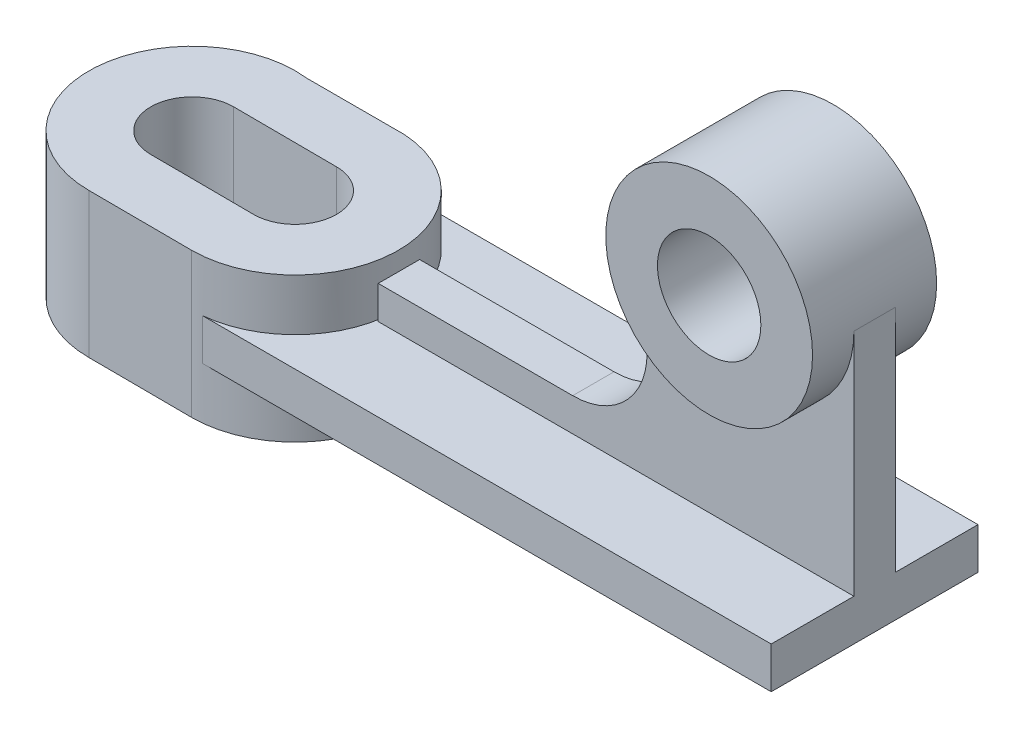
ISO-10303-21;
HEADER;
FILE_DESCRIPTION(('STEP AP214'),'2;1');
FILE_NAME('part.step','',(''),(''),'','','');
FILE_SCHEMA(('AUTOMOTIVE_DESIGN { 1 0 10303 214 1 1 1 1 }'));
ENDSEC;
DATA;
#1=APPLICATION_CONTEXT('core data for automotive mechanical design processes');
#2=APPLICATION_PROTOCOL_DEFINITION('international standard','automotive_design',2000,#1);
#3=PRODUCT_CONTEXT('',#1,'mechanical');
#4=PRODUCT('Part','Part','',(#3));
#5=PRODUCT_RELATED_PRODUCT_CATEGORY('part','',(#4));
#6=PRODUCT_DEFINITION_FORMATION('','',#4);
#7=PRODUCT_DEFINITION_CONTEXT('part definition',#1,'design');
#8=PRODUCT_DEFINITION('design','',#6,#7);
#9=PRODUCT_DEFINITION_SHAPE('','',#8);
#10=(LENGTH_UNIT() NAMED_UNIT(*) SI_UNIT(.MILLI.,.METRE.));
#11=(NAMED_UNIT(*) PLANE_ANGLE_UNIT() SI_UNIT($,.RADIAN.));
#12=(NAMED_UNIT(*) SI_UNIT($,.STERADIAN.) SOLID_ANGLE_UNIT());
#13=UNCERTAINTY_MEASURE_WITH_UNIT(LENGTH_MEASURE(1.E-05),#10,'distance_accuracy_value','');
#14=(GEOMETRIC_REPRESENTATION_CONTEXT(3) GLOBAL_UNCERTAINTY_ASSIGNED_CONTEXT((#13)) GLOBAL_UNIT_ASSIGNED_CONTEXT((#10,
#11,#12)) REPRESENTATION_CONTEXT('',''));
#15=CARTESIAN_POINT('',(0.,0.,0.));
#16=DIRECTION('',(0.,0.,1.));
#17=DIRECTION('',(1.,0.,0.));
#18=AXIS2_PLACEMENT_3D('',#15,#16,#17);
#19=CARTESIAN_POINT('',(0.,10.,0.));
#20=DIRECTION('',(0.,1.,0.));
#21=DIRECTION('',(0.,0.,1.));
#22=AXIS2_PLACEMENT_3D('',#19,#20,#21);
#23=PLANE('',#22);
#24=DIRECTION('',(0.,0.,-1.));
#25=VECTOR('',#24,1.);
#26=CARTESIAN_POINT('',(87.1408823579827,10.,-28.4439768481135));
#27=LINE('',#26,#25);
#28=CARTESIAN_POINT('',(87.1408823579827,10.,21.5560231518865));
#29=VERTEX_POINT('',#28);
#30=CARTESIAN_POINT('',(87.1408823579827,10.,1.55602315188651));
#31=VERTEX_POINT('',#30);
#32=EDGE_CURVE('E298',#29,#31,#27,.T.);
#33=ORIENTED_EDGE('',*,*,#32,.T.);
#34=DIRECTION('',(1.,0.,0.));
#35=VECTOR('',#34,1.);
#36=CARTESIAN_POINT('',(87.1408823579827,10.,1.55602315188651));
#37=LINE('',#36,#35);
#38=CARTESIAN_POINT('',(-27.8697354682345,10.,1.55602315188651));
#39=VERTEX_POINT('',#38);
#40=EDGE_CURVE('E258',#39,#31,#37,.T.);
#41=ORIENTED_EDGE('',*,*,#40,.F.);
#42=DIRECTION('',(0.,0.,1.));
#43=VECTOR('',#42,1.);
#44=CARTESIAN_POINT('',(-27.8697354682345,10.,-8.44397684811349));
#45=LINE('',#44,#43);
#46=CARTESIAN_POINT('',(-27.8697354682345,10.,-2.5831586748666));
#47=VERTEX_POINT('',#46);
#48=EDGE_CURVE('E260',#47,#39,#45,.T.);
#49=ORIENTED_EDGE('',*,*,#48,.F.);
#50=CARTESIAN_POINT('',(-52.8588817285153,10.,-3.3197516305044));
#51=DIRECTION('',(0.,1.,0.));
#52=DIRECTION('',(0.,0.,1.));
#53=AXIS2_PLACEMENT_3D('',#50,#51,#52);
#54=CIRCLE('',#53,25.);
#55=CARTESIAN_POINT('',(-50.3697395116533,10.,21.5560231518865));
#56=VERTEX_POINT('',#55);
#57=EDGE_CURVE('E348',#47,#56,#54,.F.);
#58=ORIENTED_EDGE('',*,*,#57,.T.);
#59=DIRECTION('',(1.,0.,0.));
#60=VECTOR('',#59,1.);
#61=CARTESIAN_POINT('',(-52.8591176420173,10.,21.5560231518865));
#62=LINE('',#61,#60);
#63=EDGE_CURVE('E299',#56,#29,#62,.T.);
#64=ORIENTED_EDGE('',*,*,#63,.T.);
#65=EDGE_LOOP('',(#33,#41,#49,#58,#64));
#66=FACE_BOUND('',#65,.T.);
#67=ADVANCED_FACE('F42',(#66),#23,.T.);
#68=CARTESIAN_POINT('',(-52.8591176420173,10.,-28.4439768481135));
#69=DIRECTION('',(1.,0.,0.));
#70=DIRECTION('',(0.,0.,-1.));
#71=AXIS2_PLACEMENT_3D('',#68,#69,#70);
#72=PLANE('',#71);
#73=DIRECTION('',(0.,-1.,0.));
#74=VECTOR('',#73,1.);
#75=CARTESIAN_POINT('',(-52.8591176420173,10.,-28.27501791205));
#76=LINE('',#75,#74);
#77=CARTESIAN_POINT('',(-52.8591176420173,10.,-28.27501791205));
#78=VERTEX_POINT('',#77);
#79=CARTESIAN_POINT('',(-52.8591176420173,0.,-28.27501791205));
#80=VERTEX_POINT('',#79);
#81=EDGE_CURVE('E406',#78,#80,#76,.T.);
#82=ORIENTED_EDGE('',*,*,#81,.F.);
#83=DIRECTION('',(0.,0.,1.));
#84=VECTOR('',#83,1.);
#85=CARTESIAN_POINT('',(-52.8591176420173,10.,-28.4439768481135));
#86=LINE('',#85,#84);
#87=CARTESIAN_POINT('',(-52.8591176420173,10.,-28.4439768481135));
#88=VERTEX_POINT('',#87);
#89=EDGE_CURVE('E318',#88,#78,#86,.T.);
#90=ORIENTED_EDGE('',*,*,#89,.F.);
#91=DIRECTION('',(0.,-1.,0.));
#92=VECTOR('',#91,1.);
#93=CARTESIAN_POINT('',(-52.8591176420173,10.,-28.4439768481135));
#94=LINE('',#93,#92);
#95=CARTESIAN_POINT('',(-52.8591176420173,0.,-28.4439768481135));
#96=VERTEX_POINT('',#95);
#97=EDGE_CURVE('E307',#88,#96,#94,.T.);
#98=ORIENTED_EDGE('',*,*,#97,.T.);
#99=DIRECTION('',(0.,0.,1.));
#100=VECTOR('',#99,1.);
#101=CARTESIAN_POINT('',(-52.8591176420173,0.,-28.4439768481135));
#102=LINE('',#101,#100);
#103=EDGE_CURVE('E308',#96,#80,#102,.T.);
#104=ORIENTED_EDGE('',*,*,#103,.T.);
#105=EDGE_LOOP('',(#82,#90,#98,#104));
#106=FACE_BOUND('',#105,.T.);
#107=ADVANCED_FACE('F403',(#106),#72,.F.);
#108=CARTESIAN_POINT('',(-52.8591176420173,10.,21.5560231518865));
#109=DIRECTION('',(0.,0.,-1.));
#110=DIRECTION('',(-1.,0.,0.));
#111=AXIS2_PLACEMENT_3D('',#108,#109,#110);
#112=PLANE('',#111);
#113=DIRECTION('',(0.,-1.,0.));
#114=VECTOR('',#113,1.);
#115=CARTESIAN_POINT('',(-50.3697395116533,10.,21.5560231518865));
#116=LINE('',#115,#114);
#117=CARTESIAN_POINT('',(-50.3697395116533,0.,21.5560231518865));
#118=VERTEX_POINT('',#117);
#119=EDGE_CURVE('E415',#118,#56,#116,.F.);
#120=ORIENTED_EDGE('',*,*,#119,.F.);
#121=DIRECTION('',(1.,0.,0.));
#122=VECTOR('',#121,1.);
#123=CARTESIAN_POINT('',(-52.8591176420173,0.,21.5560231518865));
#124=LINE('',#123,#122);
#125=CARTESIAN_POINT('',(87.1408823579827,0.,21.5560231518865));
#126=VERTEX_POINT('',#125);
#127=EDGE_CURVE('E311',#118,#126,#124,.T.);
#128=ORIENTED_EDGE('',*,*,#127,.T.);
#129=DIRECTION('',(0.,-1.,0.));
#130=VECTOR('',#129,1.);
#131=CARTESIAN_POINT('',(87.1408823579827,10.,21.5560231518865));
#132=LINE('',#131,#130);
#133=EDGE_CURVE('E324',#29,#126,#132,.T.);
#134=ORIENTED_EDGE('',*,*,#133,.F.);
#135=ORIENTED_EDGE('',*,*,#63,.F.);
#136=EDGE_LOOP('',(#120,#128,#134,#135));
#137=FACE_BOUND('',#136,.T.);
#138=ADVANCED_FACE('F391',(#137),#112,.F.);
#139=CARTESIAN_POINT('',(87.1408823579827,10.,-28.4439768481135));
#140=DIRECTION('',(-1.,0.,0.));
#141=DIRECTION('',(0.,0.,1.));
#142=AXIS2_PLACEMENT_3D('',#139,#140,#141);
#143=PLANE('',#142);
#144=DIRECTION('',(0.,0.,-1.));
#145=VECTOR('',#144,1.);
#146=CARTESIAN_POINT('',(87.1408823579827,0.,-28.4439768481135));
#147=LINE('',#146,#145);
#148=CARTESIAN_POINT('',(87.1408823579827,0.,-28.4439768481135));
#149=VERTEX_POINT('',#148);
#150=EDGE_CURVE('E314',#126,#149,#147,.T.);
#151=ORIENTED_EDGE('',*,*,#150,.T.);
#152=DIRECTION('',(0.,-1.,0.));
#153=VECTOR('',#152,1.);
#154=CARTESIAN_POINT('',(87.1408823579827,10.,-28.4439768481135));
#155=LINE('',#154,#153);
#156=CARTESIAN_POINT('',(87.1408823579827,10.,-28.4439768481135));
#157=VERTEX_POINT('',#156);
#158=EDGE_CURVE('E321',#157,#149,#155,.T.);
#159=ORIENTED_EDGE('',*,*,#158,.F.);
#160=CARTESIAN_POINT('',(87.1408823579827,10.,-8.44397684811349));
#161=VERTEX_POINT('',#160);
#162=EDGE_CURVE('E244',#161,#157,#27,.T.);
#163=ORIENTED_EDGE('',*,*,#162,.F.);
#164=DIRECTION('',(0.,1.,0.));
#165=VECTOR('',#164,1.);
#166=CARTESIAN_POINT('',(87.1408823579827,10.,-8.44397684811349));
#167=LINE('',#166,#165);
#168=CARTESIAN_POINT('',(87.1408823579827,65.5003945484716,-8.44397684811349));
#169=VERTEX_POINT('',#168);
#170=EDGE_CURVE('E235',#161,#169,#167,.T.);
#171=ORIENTED_EDGE('',*,*,#170,.T.);
#172=DIRECTION('',(0.,0.,1.));
#173=VECTOR('',#172,1.);
#174=CARTESIAN_POINT('',(87.1408823579827,65.5003945484716,-8.44397684811349));
#175=LINE('',#174,#173);
#176=CARTESIAN_POINT('',(87.1408823579827,65.5003945484716,1.55602315188651));
#177=VERTEX_POINT('',#176);
#178=EDGE_CURVE('E218',#169,#177,#175,.T.);
#179=ORIENTED_EDGE('',*,*,#178,.T.);
#180=DIRECTION('',(0.,1.,0.));
#181=VECTOR('',#180,1.);
#182=CARTESIAN_POINT('',(87.1408823579827,10.,1.55602315188651));
#183=LINE('',#182,#181);
#184=EDGE_CURVE('E230',#31,#177,#183,.T.);
#185=ORIENTED_EDGE('',*,*,#184,.F.);
#186=ORIENTED_EDGE('',*,*,#32,.F.);
#187=ORIENTED_EDGE('',*,*,#133,.T.);
#188=EDGE_LOOP('',(#151,#159,#163,#171,#179,#185,#186,#187));
#189=FACE_BOUND('',#188,.T.);
#190=ADVANCED_FACE('F242',(#189),#143,.F.);
#191=CARTESIAN_POINT('',(-52.8591176420173,10.,-28.4439768481135));
#192=DIRECTION('',(0.,0.,1.));
#193=DIRECTION('',(1.,0.,0.));
#194=AXIS2_PLACEMENT_3D('',#191,#192,#193);
#195=PLANE('',#194);
#196=DIRECTION('',(-1.,0.,0.));
#197=VECTOR('',#196,1.);
#198=CARTESIAN_POINT('',(-52.8591176420173,0.,-28.4439768481135));
#199=LINE('',#198,#197);
#200=EDGE_CURVE('E316',#149,#96,#199,.T.);
#201=ORIENTED_EDGE('',*,*,#200,.T.);
#202=ORIENTED_EDGE('',*,*,#97,.F.);
#203=DIRECTION('',(-1.,0.,0.));
#204=VECTOR('',#203,1.);
#205=CARTESIAN_POINT('',(-52.8591176420173,10.,-28.4439768481135));
#206=LINE('',#205,#204);
#207=EDGE_CURVE('E304',#157,#88,#206,.T.);
#208=ORIENTED_EDGE('',*,*,#207,.F.);
#209=ORIENTED_EDGE('',*,*,#158,.T.);
#210=EDGE_LOOP('',(#201,#202,#208,#209));
#211=FACE_BOUND('',#210,.T.);
#212=ADVANCED_FACE('F399',(#211),#195,.F.);
#213=DIRECTION('',(1.,0.,0.));
#214=VECTOR('',#213,1.);
#215=CARTESIAN_POINT('',(87.1408823579827,10.,-8.44397684811349));
#216=LINE('',#215,#214);
#217=CARTESIAN_POINT('',(-27.8697354682345,10.,-8.44397684811349));
#218=VERTEX_POINT('',#217);
#219=EDGE_CURVE('E363',#218,#161,#216,.T.);
#220=ORIENTED_EDGE('',*,*,#219,.T.);
#221=ORIENTED_EDGE('',*,*,#162,.T.);
#222=ORIENTED_EDGE('',*,*,#207,.T.);
#223=ORIENTED_EDGE('',*,*,#89,.T.);
#224=DIRECTION('',(1.,0.,0.));
#225=VECTOR('',#224,1.);
#226=CARTESIAN_POINT('',(0.,10.,-28.27501791205));
#227=LINE('',#226,#225);
#228=CARTESIAN_POINT('',(-51.3639955063729,10.,-28.27501791205));
#229=VERTEX_POINT('',#228);
#230=EDGE_CURVE('E312',#78,#229,#227,.T.);
#231=ORIENTED_EDGE('',*,*,#230,.T.);
#232=CARTESIAN_POINT('',(-27.8697354682345,10.,-4.0563445861422));
#233=VERTEX_POINT('',#232);
#234=EDGE_CURVE('E412',#229,#233,#54,.F.);
#235=ORIENTED_EDGE('',*,*,#234,.T.);
#236=EDGE_CURVE('E361',#218,#233,#45,.T.);
#237=ORIENTED_EDGE('',*,*,#236,.F.);
#238=EDGE_LOOP('',(#220,#221,#222,#223,#231,#235,#237));
#239=FACE_BOUND('',#238,.T.);
#240=ADVANCED_FACE('F603',(#239),#23,.T.);
#241=CARTESIAN_POINT('',(0.,0.,0.));
#242=DIRECTION('',(0.,1.,0.));
#243=DIRECTION('',(0.,0.,1.));
#244=AXIS2_PLACEMENT_3D('',#241,#242,#243);
#245=PLANE('',#244);
#246=DIRECTION('',(1.,0.,0.));
#247=VECTOR('',#246,1.);
#248=CARTESIAN_POINT('',(0.,0.,-28.27501791205));
#249=LINE('',#248,#247);
#250=CARTESIAN_POINT('',(-51.3639955063729,0.,-28.27501791205));
#251=VERTEX_POINT('',#250);
#252=EDGE_CURVE('E337',#80,#251,#249,.T.);
#253=ORIENTED_EDGE('',*,*,#252,.F.);
#254=ORIENTED_EDGE('',*,*,#103,.F.);
#255=ORIENTED_EDGE('',*,*,#200,.F.);
#256=ORIENTED_EDGE('',*,*,#150,.F.);
#257=ORIENTED_EDGE('',*,*,#127,.F.);
#258=CARTESIAN_POINT('',(-52.8588817285153,0.,-3.3197516305044));
#259=DIRECTION('',(0.,1.,0.));
#260=DIRECTION('',(0.,0.,1.));
#261=AXIS2_PLACEMENT_3D('',#258,#259,#260);
#262=CIRCLE('',#261,25.);
#263=EDGE_CURVE('E334',#251,#118,#262,.F.);
#264=ORIENTED_EDGE('',*,*,#263,.F.);
#265=EDGE_LOOP('',(#253,#254,#255,#256,#257,#264));
#266=FACE_BOUND('',#265,.T.);
#267=ADVANCED_FACE('F395',(#266),#245,.F.);
#268=CARTESIAN_POINT('',(-52.8588817285153,10.,-3.3197516305044));
#269=DIRECTION('',(0.,-1.,0.));
#270=DIRECTION('',(0.,0.,-1.));
#271=AXIS2_PLACEMENT_3D('',#268,#269,#270);
#272=CYLINDRICAL_SURFACE('',#271,10.0000012769118);
#273=CARTESIAN_POINT('',(-52.8588817285153,0.,-3.3197516305044));
#274=DIRECTION('',(0.,1.,0.));
#275=DIRECTION('',(0.,0.,1.));
#276=AXIS2_PLACEMENT_3D('',#273,#274,#275);
#277=CIRCLE('',#276,10.0000012769118);
#278=CARTESIAN_POINT('',(-52.8588817285155,0.,-13.3197529018507));
#279=VERTEX_POINT('',#278);
#280=CARTESIAN_POINT('',(-52.8588817285154,0.,6.68024964084186));
#281=VERTEX_POINT('',#280);
#282=EDGE_CURVE('E327',#279,#281,#277,.F.);
#283=ORIENTED_EDGE('',*,*,#282,.F.);
#284=DIRECTION('',(0.,-1.,0.));
#285=VECTOR('',#284,1.);
#286=CARTESIAN_POINT('',(-52.8588817285153,10.,-13.3197529074162));
#287=LINE('',#286,#285);
#288=CARTESIAN_POINT('',(-52.8588817285153,-12.5,-13.3197529074162));
#289=VERTEX_POINT('',#288);
#290=EDGE_CURVE('E435',#279,#289,#287,.T.);
#291=ORIENTED_EDGE('',*,*,#290,.T.);
#292=CARTESIAN_POINT('',(-52.8588817285153,-12.5,-3.3197516305044));
#293=DIRECTION('',(0.,1.,0.));
#294=DIRECTION('',(0.,0.,1.));
#295=AXIS2_PLACEMENT_3D('',#292,#293,#294);
#296=CIRCLE('',#295,10.0000012769118);
#297=CARTESIAN_POINT('',(-52.8588817285153,-12.5,6.68024964640737));
#298=VERTEX_POINT('',#297);
#299=EDGE_CURVE('E445',#298,#289,#296,.T.);
#300=ORIENTED_EDGE('',*,*,#299,.F.);
#301=DIRECTION('',(0.,-1.,0.));
#302=VECTOR('',#301,1.);
#303=CARTESIAN_POINT('',(-52.8588817285153,10.,6.68024964640737));
#304=LINE('',#303,#302);
#305=EDGE_CURVE('E428',#281,#298,#304,.T.);
#306=ORIENTED_EDGE('',*,*,#305,.F.);
#307=EDGE_LOOP('',(#283,#291,#300,#306));
#308=FACE_BOUND('',#307,.T.);
#309=ADVANCED_FACE('F568',(#308),#272,.F.);
#310=CARTESIAN_POINT('',(0.,-12.5,0.));
#311=DIRECTION('',(0.,1.,0.));
#312=DIRECTION('',(0.,0.,1.));
#313=AXIS2_PLACEMENT_3D('',#310,#311,#312);
#314=PLANE('',#313);
#315=DIRECTION('',(-1.,0.,0.));
#316=VECTOR('',#315,1.);
#317=CARTESIAN_POINT('',(-51.3639955063729,-12.5,-28.27501791205));
#318=LINE('',#317,#316);
#319=CARTESIAN_POINT('',(-51.3639955063729,-12.5,-28.27501791205));
#320=VERTEX_POINT('',#319);
#321=CARTESIAN_POINT('',(-74.9733362885466,-12.5,-28.27501791205));
#322=VERTEX_POINT('',#321);
#323=EDGE_CURVE('E422',#320,#322,#318,.T.);
#324=ORIENTED_EDGE('',*,*,#323,.F.);
#325=CARTESIAN_POINT('',(-52.8588817285153,-12.5,-3.3197516305044));
#326=DIRECTION('',(0.,1.,0.));
#327=DIRECTION('',(0.,0.,1.));
#328=AXIS2_PLACEMENT_3D('',#325,#326,#327);
#329=CIRCLE('',#328,25.);
#330=CARTESIAN_POINT('',(-52.8588817285153,-12.5,21.6802483694956));
#331=VERTEX_POINT('',#330);
#332=EDGE_CURVE('E478',#331,#320,#329,.T.);
#333=ORIENTED_EDGE('',*,*,#332,.F.);
#334=DIRECTION('',(0.999988071990498,0.,0.00488424781580983));
#335=VECTOR('',#334,1.);
#336=CARTESIAN_POINT('',(-77.8566849616685,-12.5,21.5581514472808));
#337=LINE('',#336,#335);
#338=CARTESIAN_POINT('',(-77.8566849616685,-12.5,21.5581514472808));
#339=VERTEX_POINT('',#338);
#340=EDGE_CURVE('E485',#339,#331,#337,.T.);
#341=ORIENTED_EDGE('',*,*,#340,.F.);
#342=CARTESIAN_POINT('',(-77.8566849616684,-12.5,-3.44184855271922));
#343=DIRECTION('',(0.,1.,0.));
#344=DIRECTION('',(0.,0.,1.));
#345=AXIS2_PLACEMENT_3D('',#342,#343,#344);
#346=CIRCLE('',#345,25.);
#347=EDGE_CURVE('E484',#322,#339,#346,.T.);
#348=ORIENTED_EDGE('',*,*,#347,.F.);
#349=EDGE_LOOP('',(#324,#333,#341,#348));
#350=FACE_BOUND('',#349,.T.);
#351=DIRECTION('',(0.999988071990498,0.,0.00488424781580983));
#352=VECTOR('',#351,1.);
#353=CARTESIAN_POINT('',(-77.8566849616685,-12.5,6.55815272419255));
#354=LINE('',#353,#352);
#355=CARTESIAN_POINT('',(-77.8566849616685,-12.5,6.55815272419255));
#356=VERTEX_POINT('',#355);
#357=EDGE_CURVE('E448',#356,#298,#354,.T.);
#358=ORIENTED_EDGE('',*,*,#357,.T.);
#359=ORIENTED_EDGE('',*,*,#299,.T.);
#360=DIRECTION('',(-0.999988071990498,0.,-0.00488424781580983));
#361=VECTOR('',#360,1.);
#362=CARTESIAN_POINT('',(-77.8566849616685,-12.5,-13.441849829631));
#363=LINE('',#362,#361);
#364=CARTESIAN_POINT('',(-77.8566849616685,-12.5,-13.441849829631));
#365=VERTEX_POINT('',#364);
#366=EDGE_CURVE('E458',#289,#365,#363,.T.);
#367=ORIENTED_EDGE('',*,*,#366,.T.);
#368=CARTESIAN_POINT('',(-77.8566849616684,-12.5,-3.44184855271922));
#369=DIRECTION('',(0.,1.,0.));
#370=DIRECTION('',(0.,0.,1.));
#371=AXIS2_PLACEMENT_3D('',#368,#369,#370);
#372=CIRCLE('',#371,10.0000012769118);
#373=EDGE_CURVE('E465',#365,#356,#372,.T.);
#374=ORIENTED_EDGE('',*,*,#373,.T.);
#375=EDGE_LOOP('',(#358,#359,#367,#374));
#376=FACE_BOUND('',#375,.T.);
#377=ADVANCED_FACE('F512',(#350,#376),#314,.F.);
#378=CARTESIAN_POINT('',(-51.3639955063729,10.,-28.27501791205));
#379=DIRECTION('',(0.,0.,1.));
#380=DIRECTION('',(1.,0.,0.));
#381=AXIS2_PLACEMENT_3D('',#378,#379,#380);
#382=PLANE('',#381);
#383=ORIENTED_EDGE('',*,*,#230,.F.);
#384=ORIENTED_EDGE('',*,*,#81,.T.);
#385=ORIENTED_EDGE('',*,*,#252,.T.);
#386=DIRECTION('',(0.,-1.,0.));
#387=VECTOR('',#386,1.);
#388=CARTESIAN_POINT('',(-51.3639955063729,10.,-28.27501791205));
#389=LINE('',#388,#387);
#390=EDGE_CURVE('E418',#251,#320,#389,.T.);
#391=ORIENTED_EDGE('',*,*,#390,.T.);
#392=ORIENTED_EDGE('',*,*,#323,.T.);
#393=DIRECTION('',(0.,-1.,0.));
#394=VECTOR('',#393,1.);
#395=CARTESIAN_POINT('',(-74.9733362885466,10.,-28.27501791205));
#396=LINE('',#395,#394);
#397=CARTESIAN_POINT('',(-74.9733362885466,22.5,-28.27501791205));
#398=VERTEX_POINT('',#397);
#399=EDGE_CURVE('E475',#398,#322,#396,.T.);
#400=ORIENTED_EDGE('',*,*,#399,.F.);
#401=DIRECTION('',(-1.,0.,0.));
#402=VECTOR('',#401,1.);
#403=CARTESIAN_POINT('',(-51.3639955063729,22.5,-28.27501791205));
#404=LINE('',#403,#402);
#405=CARTESIAN_POINT('',(-51.3639955063729,22.5,-28.27501791205));
#406=VERTEX_POINT('',#405);
#407=EDGE_CURVE('E538',#406,#398,#404,.T.);
#408=ORIENTED_EDGE('',*,*,#407,.F.);
#409=EDGE_CURVE('E421',#406,#229,#389,.T.);
#410=ORIENTED_EDGE('',*,*,#409,.T.);
#411=EDGE_LOOP('',(#383,#384,#385,#391,#392,#400,#408,#410));
#412=FACE_BOUND('',#411,.T.);
#413=ADVANCED_FACE('F515',(#412),#382,.F.);
#414=CARTESIAN_POINT('',(-52.8588817285153,10.,-3.3197516305044));
#415=DIRECTION('',(0.,-1.,0.));
#416=DIRECTION('',(0.,0.,-1.));
#417=AXIS2_PLACEMENT_3D('',#414,#415,#416);
#418=CYLINDRICAL_SURFACE('',#417,25.);
#419=CARTESIAN_POINT('',(-52.8588817285153,18.0003945484716,-3.3197516305044));
#420=DIRECTION('',(0.,1.,0.));
#421=DIRECTION('',(-1.,0.,0.));
#422=AXIS2_PLACEMENT_3D('',#419,#420,#421);
#423=CIRCLE('',#422,25.);
#424=CARTESIAN_POINT('',(-27.8697354682345,18.0003945484716,-2.58315867486638));
#425=VERTEX_POINT('',#424);
#426=CARTESIAN_POINT('',(-27.8697354682345,18.0003945484716,-4.05634458614242));
#427=VERTEX_POINT('',#426);
#428=EDGE_CURVE('E340',#425,#427,#423,.T.);
#429=ORIENTED_EDGE('',*,*,#428,.T.);
#430=DIRECTION('',(0.,-1.,0.));
#431=VECTOR('',#430,1.);
#432=CARTESIAN_POINT('',(-27.8697354682345,10.,-4.0563445861422));
#433=LINE('',#432,#431);
#434=EDGE_CURVE('E288',#427,#233,#433,.T.);
#435=ORIENTED_EDGE('',*,*,#434,.T.);
#436=ORIENTED_EDGE('',*,*,#234,.F.);
#437=ORIENTED_EDGE('',*,*,#409,.F.);
#438=CARTESIAN_POINT('',(-52.8588817285153,22.5,-3.3197516305044));
#439=DIRECTION('',(0.,1.,0.));
#440=DIRECTION('',(0.,0.,1.));
#441=AXIS2_PLACEMENT_3D('',#438,#439,#440);
#442=CIRCLE('',#441,25.);
#443=CARTESIAN_POINT('',(-52.8588817285153,22.5,21.6802483694956));
#444=VERTEX_POINT('',#443);
#445=EDGE_CURVE('E527',#444,#406,#442,.T.);
#446=ORIENTED_EDGE('',*,*,#445,.F.);
#447=DIRECTION('',(0.,-1.,0.));
#448=VECTOR('',#447,1.);
#449=CARTESIAN_POINT('',(-52.8588817285153,10.,21.6802483694956));
#450=LINE('',#449,#448);
#451=EDGE_CURVE('E496',#444,#331,#450,.T.);
#452=ORIENTED_EDGE('',*,*,#451,.T.);
#453=ORIENTED_EDGE('',*,*,#332,.T.);
#454=ORIENTED_EDGE('',*,*,#390,.F.);
#455=ORIENTED_EDGE('',*,*,#263,.T.);
#456=ORIENTED_EDGE('',*,*,#119,.T.);
#457=ORIENTED_EDGE('',*,*,#57,.F.);
#458=DIRECTION('',(0.,-1.,0.));
#459=VECTOR('',#458,1.);
#460=CARTESIAN_POINT('',(-27.8697354682345,10.,-2.5831586748666));
#461=LINE('',#460,#459);
#462=EDGE_CURVE('E293',#47,#425,#461,.F.);
#463=ORIENTED_EDGE('',*,*,#462,.T.);
#464=EDGE_LOOP('',(#429,#435,#436,#437,#446,#452,#453,#454,#455,#456,#457,#463));
#465=FACE_BOUND('',#464,.T.);
#466=ADVANCED_FACE('F346',(#465),#418,.T.);
#467=CARTESIAN_POINT('',(-77.8566849616685,10.,21.5581514472808));
#468=DIRECTION('',(0.00488424781580983,0.,-0.999988071990498));
#469=DIRECTION('',(-0.999988071990498,0.,-0.00488424781580983));
#470=AXIS2_PLACEMENT_3D('',#467,#468,#469);
#471=PLANE('',#470);
#472=ORIENTED_EDGE('',*,*,#340,.T.);
#473=ORIENTED_EDGE('',*,*,#451,.F.);
#474=DIRECTION('',(0.999988071990498,0.,0.00488424781580983));
#475=VECTOR('',#474,1.);
#476=CARTESIAN_POINT('',(-77.8566849616685,22.5,21.5581514472808));
#477=LINE('',#476,#475);
#478=CARTESIAN_POINT('',(-77.8566849616685,22.5,21.5581514472808));
#479=VERTEX_POINT('',#478);
#480=EDGE_CURVE('E525',#479,#444,#477,.T.);
#481=ORIENTED_EDGE('',*,*,#480,.F.);
#482=DIRECTION('',(0.,-1.,0.));
#483=VECTOR('',#482,1.);
#484=CARTESIAN_POINT('',(-77.8566849616685,10.,21.5581514472808));
#485=LINE('',#484,#483);
#486=EDGE_CURVE('E481',#479,#339,#485,.T.);
#487=ORIENTED_EDGE('',*,*,#486,.T.);
#488=EDGE_LOOP('',(#472,#473,#481,#487));
#489=FACE_BOUND('',#488,.T.);
#490=ADVANCED_FACE('F644',(#489),#471,.F.);
#491=CARTESIAN_POINT('',(-77.8566849616684,10.,-3.44184855271922));
#492=DIRECTION('',(0.,-1.,0.));
#493=DIRECTION('',(0.,0.,-1.));
#494=AXIS2_PLACEMENT_3D('',#491,#492,#493);
#495=CYLINDRICAL_SURFACE('',#494,25.);
#496=ORIENTED_EDGE('',*,*,#347,.T.);
#497=ORIENTED_EDGE('',*,*,#486,.F.);
#498=CARTESIAN_POINT('',(-77.8566849616684,22.5,-3.44184855271922));
#499=DIRECTION('',(0.,1.,0.));
#500=DIRECTION('',(0.,0.,1.));
#501=AXIS2_PLACEMENT_3D('',#498,#499,#500);
#502=CIRCLE('',#501,25.);
#503=EDGE_CURVE('E451',#398,#479,#502,.T.);
#504=ORIENTED_EDGE('',*,*,#503,.F.);
#505=ORIENTED_EDGE('',*,*,#399,.T.);
#506=EDGE_LOOP('',(#496,#497,#504,#505));
#507=FACE_BOUND('',#506,.T.);
#508=ADVANCED_FACE('F520',(#507),#495,.T.);
#509=CARTESIAN_POINT('',(-77.8566849616685,10.,6.55815272419255));
#510=DIRECTION('',(0.00488424781580983,0.,-0.999988071990498));
#511=DIRECTION('',(-0.999988071990498,0.,-0.00488424781580983));
#512=AXIS2_PLACEMENT_3D('',#509,#510,#511);
#513=PLANE('',#512);
#514=DIRECTION('',(0.,1.,0.));
#515=VECTOR('',#514,1.);
#516=CARTESIAN_POINT('',(-52.8591176420173,10.,6.68024849413362));
#517=LINE('',#516,#515);
#518=CARTESIAN_POINT('',(-52.8591176420173,0.,6.68024849413362));
#519=VERTEX_POINT('',#518);
#520=CARTESIAN_POINT('',(-52.8591176420173,10.,6.68024964362462));
#521=VERTEX_POINT('',#520);
#522=EDGE_CURVE('E582',#519,#521,#517,.T.);
#523=ORIENTED_EDGE('',*,*,#522,.F.);
#524=DIRECTION('',(-0.999988071990498,0.,-0.00488424781580983));
#525=VECTOR('',#524,1.);
#526=CARTESIAN_POINT('',(-0.0338886005239008,0.,6.93826308129964));
#527=LINE('',#526,#525);
#528=EDGE_CURVE('E332',#281,#519,#527,.T.);
#529=ORIENTED_EDGE('',*,*,#528,.F.);
#530=ORIENTED_EDGE('',*,*,#305,.T.);
#531=ORIENTED_EDGE('',*,*,#357,.F.);
#532=DIRECTION('',(0.,-1.,0.));
#533=VECTOR('',#532,1.);
#534=CARTESIAN_POINT('',(-77.8566849616685,10.,6.55815272419255));
#535=LINE('',#534,#533);
#536=CARTESIAN_POINT('',(-77.8566849616685,22.5,6.55815272419255));
#537=VERTEX_POINT('',#536);
#538=EDGE_CURVE('E434',#537,#356,#535,.T.);
#539=ORIENTED_EDGE('',*,*,#538,.F.);
#540=DIRECTION('',(0.999988071990498,0.,0.00488424781580983));
#541=VECTOR('',#540,1.);
#542=CARTESIAN_POINT('',(-77.8566849616685,22.5,6.55815272419255));
#543=LINE('',#542,#541);
#544=CARTESIAN_POINT('',(-52.8588817285153,22.5,6.68024964640737));
#545=VERTEX_POINT('',#544);
#546=EDGE_CURVE('E550',#537,#545,#543,.T.);
#547=ORIENTED_EDGE('',*,*,#546,.T.);
#548=CARTESIAN_POINT('',(-52.8588817285154,10.,6.68024964084186));
#549=VERTEX_POINT('',#548);
#550=EDGE_CURVE('E433',#545,#549,#304,.T.);
#551=ORIENTED_EDGE('',*,*,#550,.T.);
#552=DIRECTION('',(-0.999988071990498,0.,-0.00488424781580983));
#553=VECTOR('',#552,1.);
#554=CARTESIAN_POINT('',(-0.0338886005239008,10.,6.93826308129964));
#555=LINE('',#554,#553);
#556=EDGE_CURVE('E417',#549,#521,#555,.T.);
#557=ORIENTED_EDGE('',*,*,#556,.T.);
#558=EDGE_LOOP('',(#523,#529,#530,#531,#539,#547,#551,#557));
#559=FACE_BOUND('',#558,.T.);
#560=ADVANCED_FACE('F580',(#559),#513,.T.);
#561=CARTESIAN_POINT('',(-77.8566849616684,10.,-3.44184855271922));
#562=DIRECTION('',(0.,-1.,0.));
#563=DIRECTION('',(0.,0.,-1.));
#564=AXIS2_PLACEMENT_3D('',#561,#562,#563);
#565=CYLINDRICAL_SURFACE('',#564,10.0000012769118);
#566=ORIENTED_EDGE('',*,*,#373,.F.);
#567=DIRECTION('',(0.,-1.,0.));
#568=VECTOR('',#567,1.);
#569=CARTESIAN_POINT('',(-77.8566849616685,10.,-13.441849829631));
#570=LINE('',#569,#568);
#571=CARTESIAN_POINT('',(-77.8566849616685,22.5,-13.441849829631));
#572=VERTEX_POINT('',#571);
#573=EDGE_CURVE('E460',#572,#365,#570,.T.);
#574=ORIENTED_EDGE('',*,*,#573,.F.);
#575=CARTESIAN_POINT('',(-77.8566849616684,22.5,-3.44184855271922));
#576=DIRECTION('',(0.,1.,0.));
#577=DIRECTION('',(0.,0.,1.));
#578=AXIS2_PLACEMENT_3D('',#575,#576,#577);
#579=CIRCLE('',#578,10.0000012769118);
#580=EDGE_CURVE('E547',#572,#537,#579,.T.);
#581=ORIENTED_EDGE('',*,*,#580,.T.);
#582=ORIENTED_EDGE('',*,*,#538,.T.);
#583=EDGE_LOOP('',(#566,#574,#581,#582));
#584=FACE_BOUND('',#583,.T.);
#585=ADVANCED_FACE('F639',(#584),#565,.F.);
#586=CARTESIAN_POINT('',(-77.8566849616685,10.,-13.441849829631));
#587=DIRECTION('',(-0.00488424781580983,0.,0.999988071990498));
#588=DIRECTION('',(0.999988071990498,0.,0.00488424781580983));
#589=AXIS2_PLACEMENT_3D('',#586,#587,#588);
#590=PLANE('',#589);
#591=ORIENTED_EDGE('',*,*,#573,.T.);
#592=ORIENTED_EDGE('',*,*,#366,.F.);
#593=ORIENTED_EDGE('',*,*,#290,.F.);
#594=DIRECTION('',(0.999988071990498,0.,0.00488424781580983));
#595=VECTOR('',#594,1.);
#596=CARTESIAN_POINT('',(0.063795203078567,0.,-13.0612623549285));
#597=LINE('',#596,#595);
#598=CARTESIAN_POINT('',(-52.8591176420173,0.,-13.3197529046334));
#599=VERTEX_POINT('',#598);
#600=EDGE_CURVE('E330',#599,#279,#597,.T.);
#601=ORIENTED_EDGE('',*,*,#600,.F.);
#602=DIRECTION('',(0.,-1.,0.));
#603=VECTOR('',#602,1.);
#604=CARTESIAN_POINT('',(-52.8591176420173,10.,-13.3197540596899));
#605=LINE('',#604,#603);
#606=CARTESIAN_POINT('',(-52.8591176420173,10.,-13.3197529046334));
#607=VERTEX_POINT('',#606);
#608=EDGE_CURVE('E595',#607,#599,#605,.T.);
#609=ORIENTED_EDGE('',*,*,#608,.F.);
#610=DIRECTION('',(0.999988071990498,0.,0.00488424781580983));
#611=VECTOR('',#610,1.);
#612=CARTESIAN_POINT('',(0.063795203078567,10.,-13.0612623549285));
#613=LINE('',#612,#611);
#614=CARTESIAN_POINT('',(-52.8588817285155,10.,-13.3197529018507));
#615=VERTEX_POINT('',#614);
#616=EDGE_CURVE('E585',#607,#615,#613,.T.);
#617=ORIENTED_EDGE('',*,*,#616,.T.);
#618=CARTESIAN_POINT('',(-52.8588817285153,22.5,-13.3197529074162));
#619=VERTEX_POINT('',#618);
#620=EDGE_CURVE('E442',#619,#615,#287,.T.);
#621=ORIENTED_EDGE('',*,*,#620,.F.);
#622=DIRECTION('',(-0.999988071990498,0.,-0.00488424781580983));
#623=VECTOR('',#622,1.);
#624=CARTESIAN_POINT('',(-77.8566849616685,22.5,-13.441849829631));
#625=LINE('',#624,#623);
#626=EDGE_CURVE('E542',#619,#572,#625,.T.);
#627=ORIENTED_EDGE('',*,*,#626,.T.);
#628=EDGE_LOOP('',(#591,#592,#593,#601,#609,#617,#621,#627));
#629=FACE_BOUND('',#628,.T.);
#630=ADVANCED_FACE('F574',(#629),#590,.T.);
#631=ORIENTED_EDGE('',*,*,#620,.T.);
#632=CARTESIAN_POINT('',(-52.8588817285153,10.,-3.3197516305044));
#633=DIRECTION('',(0.,1.,0.));
#634=DIRECTION('',(0.,0.,1.));
#635=AXIS2_PLACEMENT_3D('',#632,#633,#634);
#636=CIRCLE('',#635,10.0000012769118);
#637=EDGE_CURVE('E492',#615,#549,#636,.F.);
#638=ORIENTED_EDGE('',*,*,#637,.T.);
#639=ORIENTED_EDGE('',*,*,#550,.F.);
#640=CARTESIAN_POINT('',(-52.8588817285153,22.5,-3.3197516305044));
#641=DIRECTION('',(0.,1.,0.));
#642=DIRECTION('',(0.,0.,1.));
#643=AXIS2_PLACEMENT_3D('',#640,#641,#642);
#644=CIRCLE('',#643,10.0000012769118);
#645=EDGE_CURVE('E540',#545,#619,#644,.T.);
#646=ORIENTED_EDGE('',*,*,#645,.T.);
#647=EDGE_LOOP('',(#631,#638,#639,#646));
#648=FACE_BOUND('',#647,.T.);
#649=ADVANCED_FACE('F591',(#648),#272,.F.);
#650=CARTESIAN_POINT('',(0.,22.5,0.));
#651=DIRECTION('',(0.,1.,0.));
#652=DIRECTION('',(0.,0.,1.));
#653=AXIS2_PLACEMENT_3D('',#650,#651,#652);
#654=PLANE('',#653);
#655=ORIENTED_EDGE('',*,*,#546,.F.);
#656=ORIENTED_EDGE('',*,*,#580,.F.);
#657=ORIENTED_EDGE('',*,*,#626,.F.);
#658=ORIENTED_EDGE('',*,*,#645,.F.);
#659=EDGE_LOOP('',(#655,#656,#657,#658));
#660=FACE_BOUND('',#659,.T.);
#661=ORIENTED_EDGE('',*,*,#407,.T.);
#662=ORIENTED_EDGE('',*,*,#503,.T.);
#663=ORIENTED_EDGE('',*,*,#480,.T.);
#664=ORIENTED_EDGE('',*,*,#445,.T.);
#665=EDGE_LOOP('',(#661,#662,#663,#664));
#666=FACE_BOUND('',#665,.T.);
#667=ADVANCED_FACE('F601',(#660,#666),#654,.T.);
#668=CARTESIAN_POINT('',(-52.8591176420173,10.,-3.3197516305044));
#669=DIRECTION('',(0.,1.,0.));
#670=DIRECTION('',(0.,0.,-1.));
#671=AXIS2_PLACEMENT_3D('',#668,#669,#670);
#672=CIRCLE('',#671,10.000001274129);
#673=EDGE_CURVE('E245',#549,#615,#672,.T.);
#674=ORIENTED_EDGE('',*,*,#673,.F.);
#675=ORIENTED_EDGE('',*,*,#637,.F.);
#676=EDGE_LOOP('',(#674,#675));
#677=FACE_BOUND('',#676,.T.);
#678=ADVANCED_FACE('F599',(#677),#23,.T.);
#679=ORIENTED_EDGE('',*,*,#282,.T.);
#680=CARTESIAN_POINT('',(-52.8591176420173,0.,-3.3197516305044));
#681=DIRECTION('',(0.,1.,0.));
#682=DIRECTION('',(0.,0.,1.));
#683=AXIS2_PLACEMENT_3D('',#680,#681,#682);
#684=CIRCLE('',#683,10.000001274129);
#685=EDGE_CURVE('E247',#281,#279,#684,.T.);
#686=ORIENTED_EDGE('',*,*,#685,.T.);
#687=EDGE_LOOP('',(#679,#686));
#688=FACE_BOUND('',#687,.T.);
#689=ADVANCED_FACE('F563',(#688),#245,.F.);
#690=CARTESIAN_POINT('',(-52.8591176420173,-40.,-3.3197516305044));
#691=DIRECTION('',(0.,1.,0.));
#692=DIRECTION('',(0.,0.,1.));
#693=AXIS2_PLACEMENT_3D('',#690,#691,#692);
#694=CYLINDRICAL_SURFACE('',#693,10.000001274129);
#695=ORIENTED_EDGE('',*,*,#522,.T.);
#696=ORIENTED_EDGE('',*,*,#556,.F.);
#697=ORIENTED_EDGE('',*,*,#673,.T.);
#698=ORIENTED_EDGE('',*,*,#616,.F.);
#699=ORIENTED_EDGE('',*,*,#608,.T.);
#700=ORIENTED_EDGE('',*,*,#600,.T.);
#701=ORIENTED_EDGE('',*,*,#685,.F.);
#702=ORIENTED_EDGE('',*,*,#528,.T.);
#703=EDGE_LOOP('',(#695,#696,#697,#698,#699,#700,#701,#702));
#704=FACE_BOUND('',#703,.T.);
#705=ADVANCED_FACE('F583',(#704),#694,.F.);
#706=CARTESIAN_POINT('',(-27.8697354682345,10.,-8.44397684811349));
#707=DIRECTION('',(-1.,0.,0.));
#708=DIRECTION('',(0.,-1.,0.));
#709=AXIS2_PLACEMENT_3D('',#706,#707,#708);
#710=PLANE('',#709);
#711=ORIENTED_EDGE('',*,*,#434,.F.);
#712=DIRECTION('',(0.,0.,1.));
#713=VECTOR('',#712,1.);
#714=CARTESIAN_POINT('',(-27.8697354682345,18.0003945484716,-8.44397684811349));
#715=LINE('',#714,#713);
#716=CARTESIAN_POINT('',(-27.8697354682345,18.0003945484716,-8.44397684811349));
#717=VERTEX_POINT('',#716);
#718=EDGE_CURVE('E380',#717,#427,#715,.T.);
#719=ORIENTED_EDGE('',*,*,#718,.F.);
#720=DIRECTION('',(0.,-1.,0.));
#721=VECTOR('',#720,1.);
#722=CARTESIAN_POINT('',(-27.8697354682345,10.,-8.44397684811349));
#723=LINE('',#722,#721);
#724=EDGE_CURVE('E378',#717,#218,#723,.T.);
#725=ORIENTED_EDGE('',*,*,#724,.T.);
#726=ORIENTED_EDGE('',*,*,#236,.T.);
#727=EDGE_LOOP('',(#711,#719,#725,#726));
#728=FACE_BOUND('',#727,.T.);
#729=ADVANCED_FACE('F663',(#728),#710,.T.);
#730=ORIENTED_EDGE('',*,*,#462,.F.);
#731=ORIENTED_EDGE('',*,*,#48,.T.);
#732=DIRECTION('',(0.,-1.,0.));
#733=VECTOR('',#732,1.);
#734=CARTESIAN_POINT('',(-27.8697354682345,10.,1.55602315188651));
#735=LINE('',#734,#733);
#736=CARTESIAN_POINT('',(-27.8697354682345,18.0003945484716,1.55602315188651));
#737=VERTEX_POINT('',#736);
#738=EDGE_CURVE('E374',#737,#39,#735,.T.);
#739=ORIENTED_EDGE('',*,*,#738,.F.);
#740=EDGE_CURVE('E356',#425,#737,#715,.T.);
#741=ORIENTED_EDGE('',*,*,#740,.F.);
#742=EDGE_LOOP('',(#730,#731,#739,#741));
#743=FACE_BOUND('',#742,.T.);
#744=ADVANCED_FACE('F352',(#743),#710,.T.);
#745=CARTESIAN_POINT('',(0.,0.,1.55602315188651));
#746=DIRECTION('',(0.,0.,-1.));
#747=DIRECTION('',(-1.,0.,0.));
#748=AXIS2_PLACEMENT_3D('',#745,#746,#747);
#749=PLANE('',#748);
#750=ORIENTED_EDGE('',*,*,#184,.T.);
#751=CARTESIAN_POINT('',(62.1408823579827,65.5003945484716,1.55602315188651));
#752=DIRECTION('',(0.,0.,-1.));
#753=DIRECTION('',(-1.,0.,0.));
#754=AXIS2_PLACEMENT_3D('',#751,#752,#753);
#755=CIRCLE('',#754,25.);
#756=CARTESIAN_POINT('',(37.1408823579827,65.5003945484716,1.55602315188651));
#757=VERTEX_POINT('',#756);
#758=EDGE_CURVE('E225',#177,#757,#755,.T.);
#759=ORIENTED_EDGE('',*,*,#758,.T.);
#760=DIRECTION('',(0.,-1.,0.));
#761=VECTOR('',#760,1.);
#762=CARTESIAN_POINT('',(37.1408823579827,65.5003945484716,1.55602315188651));
#763=LINE('',#762,#761);
#764=CARTESIAN_POINT('',(37.1408823579827,36.0003945484716,1.55602315188651));
#765=VERTEX_POINT('',#764);
#766=EDGE_CURVE('E267',#757,#765,#763,.T.);
#767=ORIENTED_EDGE('',*,*,#766,.T.);
#768=CARTESIAN_POINT('',(19.1408823579827,36.0003945484716,1.55602315188651));
#769=DIRECTION('',(0.,0.,-1.));
#770=DIRECTION('',(-1.,0.,0.));
#771=AXIS2_PLACEMENT_3D('',#768,#769,#770);
#772=CIRCLE('',#771,18.);
#773=CARTESIAN_POINT('',(19.1408823579827,18.0003945484716,1.55602315188651));
#774=VERTEX_POINT('',#773);
#775=EDGE_CURVE('E50',#765,#774,#772,.T.);
#776=ORIENTED_EDGE('',*,*,#775,.T.);
#777=DIRECTION('',(-1.,0.,0.));
#778=VECTOR('',#777,1.);
#779=CARTESIAN_POINT('',(-27.8697354682345,18.0003945484716,1.55602315188651));
#780=LINE('',#779,#778);
#781=EDGE_CURVE('E284',#774,#737,#780,.T.);
#782=ORIENTED_EDGE('',*,*,#781,.T.);
#783=ORIENTED_EDGE('',*,*,#738,.T.);
#784=ORIENTED_EDGE('',*,*,#40,.T.);
#785=EDGE_LOOP('',(#750,#759,#767,#776,#782,#783,#784));
#786=FACE_BOUND('',#785,.T.);
#787=ADVANCED_FACE('F386',(#786),#749,.F.);
#788=CARTESIAN_POINT('',(0.,0.,-8.44397684811349));
#789=DIRECTION('',(0.,0.,-1.));
#790=DIRECTION('',(-1.,0.,0.));
#791=AXIS2_PLACEMENT_3D('',#788,#789,#790);
#792=PLANE('',#791);
#793=CARTESIAN_POINT('',(62.1408823579827,65.5003945484716,-8.44397684811349));
#794=DIRECTION('',(0.,0.,-1.));
#795=DIRECTION('',(-1.,0.,0.));
#796=AXIS2_PLACEMENT_3D('',#793,#794,#795);
#797=CIRCLE('',#796,25.);
#798=CARTESIAN_POINT('',(37.1408823579827,65.5003945484716,-8.44397684811349));
#799=VERTEX_POINT('',#798);
#800=EDGE_CURVE('E222',#169,#799,#797,.T.);
#801=ORIENTED_EDGE('',*,*,#800,.F.);
#802=ORIENTED_EDGE('',*,*,#170,.F.);
#803=ORIENTED_EDGE('',*,*,#219,.F.);
#804=ORIENTED_EDGE('',*,*,#724,.F.);
#805=DIRECTION('',(-1.,0.,0.));
#806=VECTOR('',#805,1.);
#807=CARTESIAN_POINT('',(-27.8697354682345,18.0003945484716,-8.44397684811349));
#808=LINE('',#807,#806);
#809=CARTESIAN_POINT('',(19.1408823579827,18.0003945484716,-8.44397684811349));
#810=VERTEX_POINT('',#809);
#811=EDGE_CURVE('E274',#810,#717,#808,.T.);
#812=ORIENTED_EDGE('',*,*,#811,.F.);
#813=CARTESIAN_POINT('',(19.1408823579827,36.0003945484716,-8.44397684811349));
#814=DIRECTION('',(0.,0.,-1.));
#815=DIRECTION('',(-1.,0.,0.));
#816=AXIS2_PLACEMENT_3D('',#813,#814,#815);
#817=CIRCLE('',#816,18.);
#818=CARTESIAN_POINT('',(37.1408823579827,36.0003945484716,-8.44397684811349));
#819=VERTEX_POINT('',#818);
#820=EDGE_CURVE('E13',#810,#819,#817,.F.);
#821=ORIENTED_EDGE('',*,*,#820,.T.);
#822=DIRECTION('',(0.,-1.,0.));
#823=VECTOR('',#822,1.);
#824=CARTESIAN_POINT('',(37.1408823579827,65.5003945484716,-8.44397684811349));
#825=LINE('',#824,#823);
#826=EDGE_CURVE('E231',#799,#819,#825,.T.);
#827=ORIENTED_EDGE('',*,*,#826,.F.);
#828=EDGE_LOOP('',(#801,#802,#803,#804,#812,#821,#827));
#829=FACE_BOUND('',#828,.T.);
#830=ADVANCED_FACE('F234',(#829),#792,.T.);
#831=CARTESIAN_POINT('',(-27.8697354682345,18.0003945484716,-8.44397684811349));
#832=DIRECTION('',(0.,1.,0.));
#833=DIRECTION('',(-1.,0.,0.));
#834=AXIS2_PLACEMENT_3D('',#831,#832,#833);
#835=PLANE('',#834);
#836=ORIENTED_EDGE('',*,*,#781,.F.);
#837=DIRECTION('',(0.,0.,1.));
#838=VECTOR('',#837,1.);
#839=CARTESIAN_POINT('',(19.1408823579827,18.0003945484716,-8.44397684811349));
#840=LINE('',#839,#838);
#841=EDGE_CURVE('E57',#774,#810,#840,.F.);
#842=ORIENTED_EDGE('',*,*,#841,.T.);
#843=ORIENTED_EDGE('',*,*,#811,.T.);
#844=ORIENTED_EDGE('',*,*,#718,.T.);
#845=ORIENTED_EDGE('',*,*,#428,.F.);
#846=ORIENTED_EDGE('',*,*,#740,.T.);
#847=EDGE_LOOP('',(#836,#842,#843,#844,#845,#846));
#848=FACE_BOUND('',#847,.T.);
#849=ADVANCED_FACE('F385',(#848),#835,.T.);
#850=CARTESIAN_POINT('',(37.1408823579827,65.5003945484716,-8.44397684811349));
#851=DIRECTION('',(-1.,0.,0.));
#852=DIRECTION('',(0.,-1.,0.));
#853=AXIS2_PLACEMENT_3D('',#850,#851,#852);
#854=PLANE('',#853);
#855=ORIENTED_EDGE('',*,*,#826,.T.);
#856=DIRECTION('',(0.,0.,1.));
#857=VECTOR('',#856,1.);
#858=CARTESIAN_POINT('',(37.1408823579827,36.0003945484716,1.55602315188651));
#859=LINE('',#858,#857);
#860=EDGE_CURVE('E286',#819,#765,#859,.T.);
#861=ORIENTED_EDGE('',*,*,#860,.T.);
#862=ORIENTED_EDGE('',*,*,#766,.F.);
#863=DIRECTION('',(0.,0.,1.));
#864=VECTOR('',#863,1.);
#865=CARTESIAN_POINT('',(37.1408823579827,65.5003945484716,-8.44397684811349));
#866=LINE('',#865,#864);
#867=EDGE_CURVE('E265',#799,#757,#866,.T.);
#868=ORIENTED_EDGE('',*,*,#867,.F.);
#869=EDGE_LOOP('',(#855,#861,#862,#868));
#870=FACE_BOUND('',#869,.T.);
#871=ADVANCED_FACE('F668',(#870),#854,.T.);
#872=CARTESIAN_POINT('',(0.,0.,-18.4439768481135));
#873=DIRECTION('',(0.,0.,1.));
#874=DIRECTION('',(1.,0.,0.));
#875=AXIS2_PLACEMENT_3D('',#872,#873,#874);
#876=PLANE('',#875);
#877=CARTESIAN_POINT('',(62.1408823579827,65.5003945484716,-18.4439768481135));
#878=DIRECTION('',(0.,0.,1.));
#879=DIRECTION('',(1.,0.,0.));
#880=AXIS2_PLACEMENT_3D('',#877,#878,#879);
#881=CIRCLE('',#880,12.5);
#882=CARTESIAN_POINT('',(74.6408823579827,65.5003945484716,-18.4439768481135));
#883=VERTEX_POINT('',#882);
#884=EDGE_CURVE('E696',#883,#883,#881,.T.);
#885=ORIENTED_EDGE('',*,*,#884,.T.);
#886=EDGE_LOOP('',(#885));
#887=FACE_BOUND('',#886,.T.);
#888=CARTESIAN_POINT('',(62.1408823579827,65.5003945484716,-18.4439768481135));
#889=DIRECTION('',(0.,0.,1.));
#890=DIRECTION('',(1.,0.,0.));
#891=AXIS2_PLACEMENT_3D('',#888,#889,#890);
#892=CIRCLE('',#891,25.);
#893=CARTESIAN_POINT('',(87.1408823579827,65.5003945484716,-18.4439768481135));
#894=VERTEX_POINT('',#893);
#895=EDGE_CURVE('E700',#894,#894,#892,.T.);
#896=ORIENTED_EDGE('',*,*,#895,.F.);
#897=EDGE_LOOP('',(#896));
#898=FACE_BOUND('',#897,.T.);
#899=ADVANCED_FACE('F671',(#887,#898),#876,.F.);
#900=CARTESIAN_POINT('',(0.,0.,11.5560231518865));
#901=DIRECTION('',(0.,0.,1.));
#902=DIRECTION('',(1.,0.,0.));
#903=AXIS2_PLACEMENT_3D('',#900,#901,#902);
#904=PLANE('',#903);
#905=CARTESIAN_POINT('',(62.1408823579827,65.5003945484716,11.5560231518865));
#906=DIRECTION('',(0.,0.,1.));
#907=DIRECTION('',(1.,0.,0.));
#908=AXIS2_PLACEMENT_3D('',#905,#906,#907);
#909=CIRCLE('',#908,12.5);
#910=CARTESIAN_POINT('',(74.6408823579827,65.5003945484716,11.5560231518865));
#911=VERTEX_POINT('',#910);
#912=EDGE_CURVE('E699',#911,#911,#909,.T.);
#913=ORIENTED_EDGE('',*,*,#912,.F.);
#914=EDGE_LOOP('',(#913));
#915=FACE_BOUND('',#914,.T.);
#916=CARTESIAN_POINT('',(62.1408823579827,65.5003945484716,11.5560231518865));
#917=DIRECTION('',(0.,0.,1.));
#918=DIRECTION('',(1.,0.,0.));
#919=AXIS2_PLACEMENT_3D('',#916,#917,#918);
#920=CIRCLE('',#919,25.);
#921=CARTESIAN_POINT('',(87.1408823579827,65.5003945484716,11.5560231518865));
#922=VERTEX_POINT('',#921);
#923=EDGE_CURVE('E239',#922,#922,#920,.T.);
#924=ORIENTED_EDGE('',*,*,#923,.T.);
#925=EDGE_LOOP('',(#924));
#926=FACE_BOUND('',#925,.T.);
#927=ADVANCED_FACE('F679',(#915,#926),#904,.T.);
#928=CARTESIAN_POINT('',(62.1408823579827,65.5003945484716,-18.4439768481135));
#929=DIRECTION('',(0.,0.,1.));
#930=DIRECTION('',(1.,0.,0.));
#931=AXIS2_PLACEMENT_3D('',#928,#929,#930);
#932=CYLINDRICAL_SURFACE('',#931,25.);
#933=ORIENTED_EDGE('',*,*,#800,.T.);
#934=ORIENTED_EDGE('',*,*,#867,.T.);
#935=ORIENTED_EDGE('',*,*,#758,.F.);
#936=ORIENTED_EDGE('',*,*,#178,.F.);
#937=EDGE_LOOP('',(#933,#934,#935,#936));
#938=FACE_BOUND('',#937,.T.);
#939=ORIENTED_EDGE('',*,*,#895,.T.);
#940=EDGE_LOOP('',(#939));
#941=FACE_BOUND('',#940,.T.);
#942=ORIENTED_EDGE('',*,*,#923,.F.);
#943=EDGE_LOOP('',(#942));
#944=FACE_BOUND('',#943,.T.);
#945=ADVANCED_FACE('F220',(#938,#941,#944),#932,.T.);
#946=CARTESIAN_POINT('',(62.1408823579827,65.5003945484716,-18.4439768481135));
#947=DIRECTION('',(0.,0.,1.));
#948=DIRECTION('',(1.,0.,0.));
#949=AXIS2_PLACEMENT_3D('',#946,#947,#948);
#950=CYLINDRICAL_SURFACE('',#949,12.5);
#951=ORIENTED_EDGE('',*,*,#884,.F.);
#952=EDGE_LOOP('',(#951));
#953=FACE_BOUND('',#952,.T.);
#954=ORIENTED_EDGE('',*,*,#912,.T.);
#955=EDGE_LOOP('',(#954));
#956=FACE_BOUND('',#955,.T.);
#957=ADVANCED_FACE('F681',(#953,#956),#950,.F.);
#958=CARTESIAN_POINT('',(19.1408823579827,36.0003945484716,-8.44397684811349));
#959=DIRECTION('',(0.,0.,-1.));
#960=DIRECTION('',(-1.,0.,0.));
#961=AXIS2_PLACEMENT_3D('',#958,#959,#960);
#962=CYLINDRICAL_SURFACE('',#961,18.);
#963=ORIENTED_EDGE('',*,*,#820,.F.);
#964=ORIENTED_EDGE('',*,*,#841,.F.);
#965=ORIENTED_EDGE('',*,*,#775,.F.);
#966=ORIENTED_EDGE('',*,*,#860,.F.);
#967=EDGE_LOOP('',(#963,#964,#965,#966));
#968=FACE_BOUND('',#967,.T.);
#969=ADVANCED_FACE('F44',(#968),#962,.F.);
#970=CLOSED_SHELL('',(#67,#107,#138,#190,#212,#240,#267,#309,#377,#413,#466,#490,#508,#560,#585,
#630,#649,#667,#678,#689,#705,#729,#744,#787,#830,#849,#871,#899,#927,#945,#957,#969));
#971=MANIFOLD_SOLID_BREP('B2',#970);
#972=ADVANCED_BREP_SHAPE_REPRESENTATION('',(#18,#971),#14);
#973=SHAPE_DEFINITION_REPRESENTATION(#9,#972);
ENDSEC;
END-ISO-10303-21;
